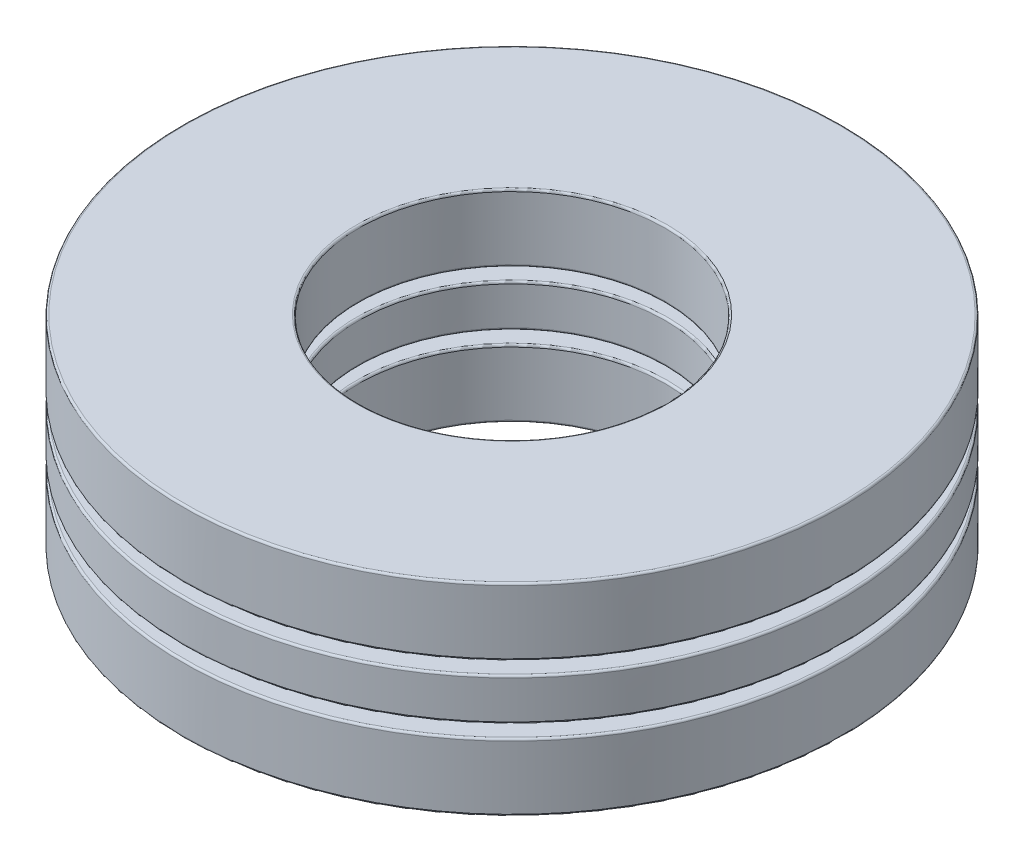
ISO-10303-21;
HEADER;
FILE_DESCRIPTION(('STEP AP214'),'2;1');
FILE_NAME('part.step','',(''),(''),'','','');
FILE_SCHEMA(('AUTOMOTIVE_DESIGN { 1 0 10303 214 1 1 1 1 }'));
ENDSEC;
DATA;
#1=APPLICATION_CONTEXT('core data for automotive mechanical design processes');
#2=APPLICATION_PROTOCOL_DEFINITION('international standard','automotive_design',2000,#1);
#3=PRODUCT_CONTEXT('',#1,'mechanical');
#4=PRODUCT('Part','Part','',(#3));
#5=PRODUCT_RELATED_PRODUCT_CATEGORY('part','',(#4));
#6=PRODUCT_DEFINITION_FORMATION('','',#4);
#7=PRODUCT_DEFINITION_CONTEXT('part definition',#1,'design');
#8=PRODUCT_DEFINITION('design','',#6,#7);
#9=PRODUCT_DEFINITION_SHAPE('','',#8);
#10=(LENGTH_UNIT() NAMED_UNIT(*) SI_UNIT(.MILLI.,.METRE.));
#11=(NAMED_UNIT(*) PLANE_ANGLE_UNIT() SI_UNIT($,.RADIAN.));
#12=(NAMED_UNIT(*) SI_UNIT($,.STERADIAN.) SOLID_ANGLE_UNIT());
#13=UNCERTAINTY_MEASURE_WITH_UNIT(LENGTH_MEASURE(1.E-05),#10,'distance_accuracy_value','');
#14=(GEOMETRIC_REPRESENTATION_CONTEXT(3) GLOBAL_UNCERTAINTY_ASSIGNED_CONTEXT((#13)) GLOBAL_UNIT_ASSIGNED_CONTEXT((#10,
#11,#12)) REPRESENTATION_CONTEXT('',''));
#15=CARTESIAN_POINT('',(0.,0.,0.));
#16=DIRECTION('',(0.,0.,1.));
#17=DIRECTION('',(1.,0.,0.));
#18=AXIS2_PLACEMENT_3D('',#15,#16,#17);
#19=CARTESIAN_POINT('',(0.,-3.1623,0.));
#20=DIRECTION('',(0.,-1.,0.));
#21=DIRECTION('',(0.,0.,-1.));
#22=AXIS2_PLACEMENT_3D('',#19,#20,#21);
#23=CYLINDRICAL_SURFACE('',#22,10.31875);
#24=CARTESIAN_POINT('',(0.,-3.099054,0.));
#25=DIRECTION('',(0.,1.,0.));
#26=DIRECTION('',(0.,0.,1.));
#27=AXIS2_PLACEMENT_3D('',#24,#25,#26);
#28=CIRCLE('',#27,10.31875);
#29=CARTESIAN_POINT('',(0.,-3.099054,10.31875));
#30=VERTEX_POINT('',#29);
#31=EDGE_CURVE('E11',#30,#30,#28,.T.);
#32=ORIENTED_EDGE('',*,*,#31,.T.);
#33=EDGE_LOOP('',(#32));
#34=FACE_BOUND('',#33,.T.);
#35=CARTESIAN_POINT('',(0.,-1.117346,0.));
#36=DIRECTION('',(0.,-1.,0.));
#37=DIRECTION('',(0.,0.,-1.));
#38=AXIS2_PLACEMENT_3D('',#35,#36,#37);
#39=CIRCLE('',#38,10.31875);
#40=CARTESIAN_POINT('',(0.,-1.117346,-10.31875));
#41=VERTEX_POINT('',#40);
#42=EDGE_CURVE('E48',#41,#41,#39,.T.);
#43=ORIENTED_EDGE('',*,*,#42,.T.);
#44=EDGE_LOOP('',(#43));
#45=FACE_BOUND('',#44,.T.);
#46=ADVANCED_FACE('F41',(#34,#45),#23,.T.);
#47=CARTESIAN_POINT('',(0.,-1.0541,10.31875));
#48=DIRECTION('',(0.,-1.,0.));
#49=DIRECTION('',(0.,0.,-1.));
#50=AXIS2_PLACEMENT_3D('',#47,#48,#49);
#51=PLANE('',#50);
#52=CARTESIAN_POINT('',(0.,-1.0541,0.));
#53=DIRECTION('',(0.,-1.,0.));
#54=DIRECTION('',(0.,0.,-1.));
#55=AXIS2_PLACEMENT_3D('',#52,#53,#54);
#56=CIRCLE('',#55,4.863846);
#57=CARTESIAN_POINT('',(0.,-1.0541,-4.863846));
#58=VERTEX_POINT('',#57);
#59=EDGE_CURVE('E52',#58,#58,#56,.T.);
#60=ORIENTED_EDGE('',*,*,#59,.T.);
#61=EDGE_LOOP('',(#60));
#62=FACE_BOUND('',#61,.T.);
#63=CARTESIAN_POINT('',(0.,-1.0541,0.));
#64=DIRECTION('',(0.,-1.,0.));
#65=DIRECTION('',(0.,0.,-1.));
#66=AXIS2_PLACEMENT_3D('',#63,#64,#65);
#67=CIRCLE('',#66,10.255504);
#68=CARTESIAN_POINT('',(0.,-1.0541,-10.255504));
#69=VERTEX_POINT('',#68);
#70=EDGE_CURVE('E56',#69,#69,#67,.F.);
#71=ORIENTED_EDGE('',*,*,#70,.T.);
#72=EDGE_LOOP('',(#71));
#73=FACE_BOUND('',#72,.T.);
#74=ADVANCED_FACE('F84',(#62,#73),#51,.F.);
#75=CARTESIAN_POINT('',(0.,-3.1623,0.));
#76=DIRECTION('',(0.,-1.,0.));
#77=DIRECTION('',(0.,0.,-1.));
#78=AXIS2_PLACEMENT_3D('',#75,#76,#77);
#79=CYLINDRICAL_SURFACE('',#78,4.8006);
#80=CARTESIAN_POINT('',(0.,-3.099054,0.));
#81=DIRECTION('',(0.,1.,0.));
#82=DIRECTION('',(0.,0.,1.));
#83=AXIS2_PLACEMENT_3D('',#80,#81,#82);
#84=CIRCLE('',#83,4.8006);
#85=CARTESIAN_POINT('',(0.,-3.099054,4.8006));
#86=VERTEX_POINT('',#85);
#87=EDGE_CURVE('E67',#86,#86,#84,.F.);
#88=ORIENTED_EDGE('',*,*,#87,.T.);
#89=EDGE_LOOP('',(#88));
#90=FACE_BOUND('',#89,.T.);
#91=CARTESIAN_POINT('',(0.,-1.117346,0.));
#92=DIRECTION('',(0.,-1.,0.));
#93=DIRECTION('',(0.,0.,-1.));
#94=AXIS2_PLACEMENT_3D('',#91,#92,#93);
#95=CIRCLE('',#94,4.8006);
#96=CARTESIAN_POINT('',(0.,-1.117346,-4.8006));
#97=VERTEX_POINT('',#96);
#98=EDGE_CURVE('E70',#97,#97,#95,.F.);
#99=ORIENTED_EDGE('',*,*,#98,.T.);
#100=EDGE_LOOP('',(#99));
#101=FACE_BOUND('',#100,.T.);
#102=ADVANCED_FACE('F74',(#90,#101),#79,.F.);
#103=CARTESIAN_POINT('',(0.,-3.1623,10.31875));
#104=DIRECTION('',(0.,1.,0.));
#105=DIRECTION('',(0.,0.,1.));
#106=AXIS2_PLACEMENT_3D('',#103,#104,#105);
#107=PLANE('',#106);
#108=CARTESIAN_POINT('',(0.,-3.1623,0.));
#109=DIRECTION('',(0.,1.,0.));
#110=DIRECTION('',(0.,0.,1.));
#111=AXIS2_PLACEMENT_3D('',#108,#109,#110);
#112=CIRCLE('',#111,4.863846);
#113=CARTESIAN_POINT('',(0.,-3.1623,4.863846));
#114=VERTEX_POINT('',#113);
#115=EDGE_CURVE('E61',#114,#114,#112,.T.);
#116=ORIENTED_EDGE('',*,*,#115,.T.);
#117=EDGE_LOOP('',(#116));
#118=FACE_BOUND('',#117,.T.);
#119=CARTESIAN_POINT('',(0.,-3.1623,0.));
#120=DIRECTION('',(0.,1.,0.));
#121=DIRECTION('',(0.,0.,1.));
#122=AXIS2_PLACEMENT_3D('',#119,#120,#121);
#123=CIRCLE('',#122,10.255504);
#124=CARTESIAN_POINT('',(0.,-3.1623,10.255504));
#125=VERTEX_POINT('',#124);
#126=EDGE_CURVE('E64',#125,#125,#123,.F.);
#127=ORIENTED_EDGE('',*,*,#126,.T.);
#128=EDGE_LOOP('',(#127));
#129=FACE_BOUND('',#128,.T.);
#130=ADVANCED_FACE('F103',(#118,#129),#107,.F.);
#131=CARTESIAN_POINT('',(0.,-3.099054,0.));
#132=DIRECTION('',(0.,1.,0.));
#133=DIRECTION('',(0.,0.,1.));
#134=AXIS2_PLACEMENT_3D('',#131,#132,#133);
#135=TOROIDAL_SURFACE('',#134,4.863846,0.063246);
#136=ORIENTED_EDGE('',*,*,#115,.F.);
#137=EDGE_LOOP('',(#136));
#138=FACE_BOUND('',#137,.T.);
#139=ORIENTED_EDGE('',*,*,#87,.F.);
#140=EDGE_LOOP('',(#139));
#141=FACE_BOUND('',#140,.T.);
#142=ADVANCED_FACE('F80',(#138,#141),#135,.T.);
#143=CARTESIAN_POINT('',(0.,-1.117346,0.));
#144=DIRECTION('',(0.,-1.,0.));
#145=DIRECTION('',(0.,0.,-1.));
#146=AXIS2_PLACEMENT_3D('',#143,#144,#145);
#147=TOROIDAL_SURFACE('',#146,4.863846,0.063246);
#148=ORIENTED_EDGE('',*,*,#98,.F.);
#149=EDGE_LOOP('',(#148));
#150=FACE_BOUND('',#149,.T.);
#151=ORIENTED_EDGE('',*,*,#59,.F.);
#152=EDGE_LOOP('',(#151));
#153=FACE_BOUND('',#152,.T.);
#154=ADVANCED_FACE('F76',(#150,#153),#147,.T.);
#155=CARTESIAN_POINT('',(0.,-3.099054,0.));
#156=DIRECTION('',(0.,1.,0.));
#157=DIRECTION('',(0.,0.,1.));
#158=AXIS2_PLACEMENT_3D('',#155,#156,#157);
#159=TOROIDAL_SURFACE('',#158,10.255504,0.063246);
#160=ORIENTED_EDGE('',*,*,#31,.F.);
#161=EDGE_LOOP('',(#160));
#162=FACE_BOUND('',#161,.T.);
#163=ORIENTED_EDGE('',*,*,#126,.F.);
#164=EDGE_LOOP('',(#163));
#165=FACE_BOUND('',#164,.T.);
#166=ADVANCED_FACE('F79',(#162,#165),#159,.T.);
#167=CARTESIAN_POINT('',(0.,-1.117346,0.));
#168=DIRECTION('',(0.,-1.,0.));
#169=DIRECTION('',(0.,0.,-1.));
#170=AXIS2_PLACEMENT_3D('',#167,#168,#169);
#171=TOROIDAL_SURFACE('',#170,10.255504,0.063246);
#172=ORIENTED_EDGE('',*,*,#70,.F.);
#173=EDGE_LOOP('',(#172));
#174=FACE_BOUND('',#173,.T.);
#175=ORIENTED_EDGE('',*,*,#42,.F.);
#176=EDGE_LOOP('',(#175));
#177=FACE_BOUND('',#176,.T.);
#178=ADVANCED_FACE('F43',(#174,#177),#171,.T.);
#179=CLOSED_SHELL('',(#46,#74,#102,#130,#142,#154,#166,#178));
#180=MANIFOLD_SOLID_BREP('B2',#179);
#181=CARTESIAN_POINT('',(0.,-3.1623,0.));
#182=DIRECTION('',(0.,-1.,0.));
#183=DIRECTION('',(0.,0.,-1.));
#184=AXIS2_PLACEMENT_3D('',#181,#182,#183);
#185=CYLINDRICAL_SURFACE('',#184,10.31875);
#186=CARTESIAN_POINT('',(0.,1.117346,0.));
#187=DIRECTION('',(0.,1.,0.));
#188=DIRECTION('',(0.,0.,1.));
#189=AXIS2_PLACEMENT_3D('',#186,#187,#188);
#190=CIRCLE('',#189,10.31875);
#191=CARTESIAN_POINT('',(0.,1.117346,10.31875));
#192=VERTEX_POINT('',#191);
#193=EDGE_CURVE('E40',#192,#192,#190,.T.);
#194=ORIENTED_EDGE('',*,*,#193,.T.);
#195=EDGE_LOOP('',(#194));
#196=FACE_BOUND('',#195,.T.);
#197=CARTESIAN_POINT('',(0.,3.099054,0.));
#198=DIRECTION('',(0.,-1.,0.));
#199=DIRECTION('',(0.,0.,-1.));
#200=AXIS2_PLACEMENT_3D('',#197,#198,#199);
#201=CIRCLE('',#200,10.31875);
#202=CARTESIAN_POINT('',(0.,3.099054,-10.31875));
#203=VERTEX_POINT('',#202);
#204=EDGE_CURVE('E175',#203,#203,#201,.T.);
#205=ORIENTED_EDGE('',*,*,#204,.T.);
#206=EDGE_LOOP('',(#205));
#207=FACE_BOUND('',#206,.T.);
#208=ADVANCED_FACE('F168',(#196,#207),#185,.T.);
#209=CARTESIAN_POINT('',(0.,3.1623,10.31875));
#210=DIRECTION('',(0.,-1.,0.));
#211=DIRECTION('',(0.,0.,-1.));
#212=AXIS2_PLACEMENT_3D('',#209,#210,#211);
#213=PLANE('',#212);
#214=CARTESIAN_POINT('',(0.,3.1623,0.));
#215=DIRECTION('',(0.,-1.,0.));
#216=DIRECTION('',(0.,0.,-1.));
#217=AXIS2_PLACEMENT_3D('',#214,#215,#216);
#218=CIRCLE('',#217,4.863846);
#219=CARTESIAN_POINT('',(0.,3.1623,-4.863846));
#220=VERTEX_POINT('',#219);
#221=EDGE_CURVE('E179',#220,#220,#218,.T.);
#222=ORIENTED_EDGE('',*,*,#221,.T.);
#223=EDGE_LOOP('',(#222));
#224=FACE_BOUND('',#223,.T.);
#225=CARTESIAN_POINT('',(0.,3.1623,0.));
#226=DIRECTION('',(0.,-1.,0.));
#227=DIRECTION('',(0.,0.,-1.));
#228=AXIS2_PLACEMENT_3D('',#225,#226,#227);
#229=CIRCLE('',#228,10.255504);
#230=CARTESIAN_POINT('',(0.,3.1623,-10.255504));
#231=VERTEX_POINT('',#230);
#232=EDGE_CURVE('E183',#231,#231,#229,.F.);
#233=ORIENTED_EDGE('',*,*,#232,.T.);
#234=EDGE_LOOP('',(#233));
#235=FACE_BOUND('',#234,.T.);
#236=ADVANCED_FACE('F211',(#224,#235),#213,.F.);
#237=CARTESIAN_POINT('',(0.,-3.1623,0.));
#238=DIRECTION('',(0.,-1.,0.));
#239=DIRECTION('',(0.,0.,-1.));
#240=AXIS2_PLACEMENT_3D('',#237,#238,#239);
#241=CYLINDRICAL_SURFACE('',#240,4.8006);
#242=CARTESIAN_POINT('',(0.,1.117346,0.));
#243=DIRECTION('',(0.,1.,0.));
#244=DIRECTION('',(0.,0.,1.));
#245=AXIS2_PLACEMENT_3D('',#242,#243,#244);
#246=CIRCLE('',#245,4.8006);
#247=CARTESIAN_POINT('',(0.,1.117346,4.8006));
#248=VERTEX_POINT('',#247);
#249=EDGE_CURVE('E194',#248,#248,#246,.F.);
#250=ORIENTED_EDGE('',*,*,#249,.T.);
#251=EDGE_LOOP('',(#250));
#252=FACE_BOUND('',#251,.T.);
#253=CARTESIAN_POINT('',(0.,3.099054,0.));
#254=DIRECTION('',(0.,-1.,0.));
#255=DIRECTION('',(0.,0.,-1.));
#256=AXIS2_PLACEMENT_3D('',#253,#254,#255);
#257=CIRCLE('',#256,4.8006);
#258=CARTESIAN_POINT('',(0.,3.099054,-4.8006));
#259=VERTEX_POINT('',#258);
#260=EDGE_CURVE('E197',#259,#259,#257,.F.);
#261=ORIENTED_EDGE('',*,*,#260,.T.);
#262=EDGE_LOOP('',(#261));
#263=FACE_BOUND('',#262,.T.);
#264=ADVANCED_FACE('F201',(#252,#263),#241,.F.);
#265=CARTESIAN_POINT('',(0.,1.0541,10.31875));
#266=DIRECTION('',(0.,1.,0.));
#267=DIRECTION('',(0.,0.,1.));
#268=AXIS2_PLACEMENT_3D('',#265,#266,#267);
#269=PLANE('',#268);
#270=CARTESIAN_POINT('',(0.,1.0541,0.));
#271=DIRECTION('',(0.,1.,0.));
#272=DIRECTION('',(0.,0.,1.));
#273=AXIS2_PLACEMENT_3D('',#270,#271,#272);
#274=CIRCLE('',#273,4.863846);
#275=CARTESIAN_POINT('',(0.,1.0541,4.863846));
#276=VERTEX_POINT('',#275);
#277=EDGE_CURVE('E188',#276,#276,#274,.T.);
#278=ORIENTED_EDGE('',*,*,#277,.T.);
#279=EDGE_LOOP('',(#278));
#280=FACE_BOUND('',#279,.T.);
#281=CARTESIAN_POINT('',(0.,1.0541,0.));
#282=DIRECTION('',(0.,1.,0.));
#283=DIRECTION('',(0.,0.,1.));
#284=AXIS2_PLACEMENT_3D('',#281,#282,#283);
#285=CIRCLE('',#284,10.255504);
#286=CARTESIAN_POINT('',(0.,1.0541,10.255504));
#287=VERTEX_POINT('',#286);
#288=EDGE_CURVE('E191',#287,#287,#285,.F.);
#289=ORIENTED_EDGE('',*,*,#288,.T.);
#290=EDGE_LOOP('',(#289));
#291=FACE_BOUND('',#290,.T.);
#292=ADVANCED_FACE('F230',(#280,#291),#269,.F.);
#293=CARTESIAN_POINT('',(0.,1.117346,0.));
#294=DIRECTION('',(0.,1.,0.));
#295=DIRECTION('',(0.,0.,1.));
#296=AXIS2_PLACEMENT_3D('',#293,#294,#295);
#297=TOROIDAL_SURFACE('',#296,4.863846,0.063246);
#298=ORIENTED_EDGE('',*,*,#277,.F.);
#299=EDGE_LOOP('',(#298));
#300=FACE_BOUND('',#299,.T.);
#301=ORIENTED_EDGE('',*,*,#249,.F.);
#302=EDGE_LOOP('',(#301));
#303=FACE_BOUND('',#302,.T.);
#304=ADVANCED_FACE('F207',(#300,#303),#297,.T.);
#305=CARTESIAN_POINT('',(0.,3.099054,0.));
#306=DIRECTION('',(0.,-1.,0.));
#307=DIRECTION('',(0.,0.,-1.));
#308=AXIS2_PLACEMENT_3D('',#305,#306,#307);
#309=TOROIDAL_SURFACE('',#308,4.863846,0.063246);
#310=ORIENTED_EDGE('',*,*,#260,.F.);
#311=EDGE_LOOP('',(#310));
#312=FACE_BOUND('',#311,.T.);
#313=ORIENTED_EDGE('',*,*,#221,.F.);
#314=EDGE_LOOP('',(#313));
#315=FACE_BOUND('',#314,.T.);
#316=ADVANCED_FACE('F203',(#312,#315),#309,.T.);
#317=CARTESIAN_POINT('',(0.,1.117346,0.));
#318=DIRECTION('',(0.,1.,0.));
#319=DIRECTION('',(0.,0.,1.));
#320=AXIS2_PLACEMENT_3D('',#317,#318,#319);
#321=TOROIDAL_SURFACE('',#320,10.255504,0.063246);
#322=ORIENTED_EDGE('',*,*,#193,.F.);
#323=EDGE_LOOP('',(#322));
#324=FACE_BOUND('',#323,.T.);
#325=ORIENTED_EDGE('',*,*,#288,.F.);
#326=EDGE_LOOP('',(#325));
#327=FACE_BOUND('',#326,.T.);
#328=ADVANCED_FACE('F206',(#324,#327),#321,.T.);
#329=CARTESIAN_POINT('',(0.,3.099054,0.));
#330=DIRECTION('',(0.,-1.,0.));
#331=DIRECTION('',(0.,0.,-1.));
#332=AXIS2_PLACEMENT_3D('',#329,#330,#331);
#333=TOROIDAL_SURFACE('',#332,10.255504,0.063246);
#334=ORIENTED_EDGE('',*,*,#232,.F.);
#335=EDGE_LOOP('',(#334));
#336=FACE_BOUND('',#335,.T.);
#337=ORIENTED_EDGE('',*,*,#204,.F.);
#338=EDGE_LOOP('',(#337));
#339=FACE_BOUND('',#338,.T.);
#340=ADVANCED_FACE('F170',(#336,#339),#333,.T.);
#341=CLOSED_SHELL('',(#208,#236,#264,#292,#304,#316,#328,#340));
#342=MANIFOLD_SOLID_BREP('B6',#341);
#343=CARTESIAN_POINT('',(-7.559675,0.,0.));
#344=DIRECTION('',(0.,1.,0.));
#345=DIRECTION('',(1.,0.,0.));
#346=AXIS2_PLACEMENT_3D('',#343,#344,#345);
#347=SPHERICAL_SURFACE('',#346,1.0541);
#348=CARTESIAN_POINT('',(-7.559675,1.0541,0.));
#349=VERTEX_POINT('',#348);
#350=VERTEX_LOOP('',#349);
#351=FACE_BOUND('',#350,.T.);
#352=ADVANCED_FACE('F295',(#351),#347,.T.);
#353=CLOSED_SHELL('',(#352));
#354=MANIFOLD_SOLID_BREP('B35',#353);
#355=CARTESIAN_POINT('',(0.,0.,-7.559675));
#356=DIRECTION('',(0.,1.,0.));
#357=DIRECTION('',(0.,0.,1.));
#358=AXIS2_PLACEMENT_3D('',#355,#356,#357);
#359=SPHERICAL_SURFACE('',#358,1.0541);
#360=CARTESIAN_POINT('',(0.,1.0541,-7.559675));
#361=VERTEX_POINT('',#360);
#362=VERTEX_LOOP('',#361);
#363=FACE_BOUND('',#362,.T.);
#364=ADVANCED_FACE('F313',(#363),#359,.T.);
#365=CLOSED_SHELL('',(#364));
#366=MANIFOLD_SOLID_BREP('B164',#365);
#367=CARTESIAN_POINT('',(7.559675,0.,0.));
#368=DIRECTION('',(0.,1.,0.));
#369=DIRECTION('',(-1.,0.,0.));
#370=AXIS2_PLACEMENT_3D('',#367,#368,#369);
#371=SPHERICAL_SURFACE('',#370,1.0541);
#372=CARTESIAN_POINT('',(7.559675,1.0541,0.));
#373=VERTEX_POINT('',#372);
#374=VERTEX_LOOP('',#373);
#375=FACE_BOUND('',#374,.T.);
#376=ADVANCED_FACE('F331',(#375),#371,.T.);
#377=CLOSED_SHELL('',(#376));
#378=MANIFOLD_SOLID_BREP('B291',#377);
#379=CARTESIAN_POINT('',(0.,0.,7.559675));
#380=DIRECTION('',(0.,1.,0.));
#381=DIRECTION('',(0.,0.,-1.));
#382=AXIS2_PLACEMENT_3D('',#379,#380,#381);
#383=SPHERICAL_SURFACE('',#382,1.0541);
#384=CARTESIAN_POINT('',(0.,1.0541,7.559675));
#385=VERTEX_POINT('',#384);
#386=VERTEX_LOOP('',#385);
#387=FACE_BOUND('',#386,.T.);
#388=ADVANCED_FACE('F350',(#387),#383,.T.);
#389=CLOSED_SHELL('',(#388));
#390=MANIFOLD_SOLID_BREP('B309',#389);
#391=CARTESIAN_POINT('',(0.,-3.1623,0.));
#392=DIRECTION('',(0.,-1.,0.));
#393=DIRECTION('',(0.,0.,-1.));
#394=AXIS2_PLACEMENT_3D('',#391,#392,#393);
#395=CYLINDRICAL_SURFACE('',#394,10.31875);
#396=CARTESIAN_POINT('',(0.,-0.595566500000002,0.));
#397=DIRECTION('',(0.,1.,0.));
#398=DIRECTION('',(0.,0.,1.));
#399=AXIS2_PLACEMENT_3D('',#396,#397,#398);
#400=CIRCLE('',#399,10.31875);
#401=CARTESIAN_POINT('',(0.,-0.595566500000002,10.31875));
#402=VERTEX_POINT('',#401);
#403=EDGE_CURVE('E349',#402,#402,#400,.T.);
#404=ORIENTED_EDGE('',*,*,#403,.T.);
#405=EDGE_LOOP('',(#404));
#406=FACE_BOUND('',#405,.T.);
#407=CARTESIAN_POINT('',(0.,0.595566499999999,0.));
#408=DIRECTION('',(0.,-1.,0.));
#409=DIRECTION('',(0.,0.,-1.));
#410=AXIS2_PLACEMENT_3D('',#407,#408,#409);
#411=CIRCLE('',#410,10.31875);
#412=CARTESIAN_POINT('',(0.,0.595566499999999,-10.31875));
#413=VERTEX_POINT('',#412);
#414=EDGE_CURVE('E369',#413,#413,#411,.T.);
#415=ORIENTED_EDGE('',*,*,#414,.T.);
#416=EDGE_LOOP('',(#415));
#417=FACE_BOUND('',#416,.T.);
#418=ADVANCED_FACE('F362',(#406,#417),#395,.T.);
#419=CARTESIAN_POINT('',(0.,-0.658812500000002,10.31875));
#420=DIRECTION('',(0.,1.,0.));
#421=DIRECTION('',(0.,0.,1.));
#422=AXIS2_PLACEMENT_3D('',#419,#420,#421);
#423=PLANE('',#422);
#424=CARTESIAN_POINT('',(0.,-0.658812500000002,0.));
#425=DIRECTION('',(0.,1.,0.));
#426=DIRECTION('',(0.,0.,1.));
#427=AXIS2_PLACEMENT_3D('',#424,#425,#426);
#428=CIRCLE('',#427,4.863846);
#429=CARTESIAN_POINT('',(0.,-0.658812500000002,4.863846));
#430=VERTEX_POINT('',#429);
#431=EDGE_CURVE('E382',#430,#430,#428,.T.);
#432=ORIENTED_EDGE('',*,*,#431,.T.);
#433=EDGE_LOOP('',(#432));
#434=FACE_BOUND('',#433,.T.);
#435=CARTESIAN_POINT('',(0.,-0.658812500000002,0.));
#436=DIRECTION('',(0.,1.,0.));
#437=DIRECTION('',(0.,0.,1.));
#438=AXIS2_PLACEMENT_3D('',#435,#436,#437);
#439=CIRCLE('',#438,10.255504);
#440=CARTESIAN_POINT('',(0.,-0.658812500000002,10.255504));
#441=VERTEX_POINT('',#440);
#442=EDGE_CURVE('E385',#441,#441,#439,.F.);
#443=ORIENTED_EDGE('',*,*,#442,.T.);
#444=EDGE_LOOP('',(#443));
#445=FACE_BOUND('',#444,.T.);
#446=CARTESIAN_POINT('',(-7.559675,-0.658812500000002,0.));
#447=DIRECTION('',(0.,1.,0.));
#448=DIRECTION('',(-1.,0.,0.));
#449=AXIS2_PLACEMENT_3D('',#446,#447,#448);
#450=CIRCLE('',#449,0.822856548763968);
#451=CARTESIAN_POINT('',(-8.38253154876397,-0.658812500000002,0.));
#452=VERTEX_POINT('',#451);
#453=EDGE_CURVE('E412',#452,#452,#450,.T.);
#454=ORIENTED_EDGE('',*,*,#453,.T.);
#455=EDGE_LOOP('',(#454));
#456=FACE_BOUND('',#455,.T.);
#457=CARTESIAN_POINT('',(0.,-0.658812500000002,-7.559675));
#458=DIRECTION('',(0.,1.,0.));
#459=DIRECTION('',(0.,0.,-1.));
#460=AXIS2_PLACEMENT_3D('',#457,#458,#459);
#461=CIRCLE('',#460,0.822856548763968);
#462=CARTESIAN_POINT('',(0.,-0.658812500000002,-8.38253154876397));
#463=VERTEX_POINT('',#462);
#464=EDGE_CURVE('E406',#463,#463,#461,.T.);
#465=ORIENTED_EDGE('',*,*,#464,.T.);
#466=EDGE_LOOP('',(#465));
#467=FACE_BOUND('',#466,.T.);
#468=CARTESIAN_POINT('',(7.559675,-0.658812500000002,0.));
#469=DIRECTION('',(0.,1.,0.));
#470=DIRECTION('',(1.,0.,0.));
#471=AXIS2_PLACEMENT_3D('',#468,#469,#470);
#472=CIRCLE('',#471,0.822856548763968);
#473=CARTESIAN_POINT('',(8.38253154876397,-0.658812500000002,0.));
#474=VERTEX_POINT('',#473);
#475=EDGE_CURVE('E398',#474,#474,#472,.T.);
#476=ORIENTED_EDGE('',*,*,#475,.T.);
#477=EDGE_LOOP('',(#476));
#478=FACE_BOUND('',#477,.T.);
#479=CARTESIAN_POINT('',(0.,-0.658812500000002,7.559675));
#480=DIRECTION('',(0.,1.,0.));
#481=DIRECTION('',(0.,0.,1.));
#482=AXIS2_PLACEMENT_3D('',#479,#480,#481);
#483=CIRCLE('',#482,0.822856548763968);
#484=CARTESIAN_POINT('',(0.,-0.658812500000002,8.38253154876397));
#485=VERTEX_POINT('',#484);
#486=EDGE_CURVE('E394',#485,#485,#483,.T.);
#487=ORIENTED_EDGE('',*,*,#486,.T.);
#488=EDGE_LOOP('',(#487));
#489=FACE_BOUND('',#488,.T.);
#490=ADVANCED_FACE('F430',(#434,#445,#456,#467,#478,#489),#423,.F.);
#491=CARTESIAN_POINT('',(0.,-3.1623,0.));
#492=DIRECTION('',(0.,-1.,0.));
#493=DIRECTION('',(0.,0.,-1.));
#494=AXIS2_PLACEMENT_3D('',#491,#492,#493);
#495=CYLINDRICAL_SURFACE('',#494,4.8006);
#496=CARTESIAN_POINT('',(0.,-0.595566500000002,0.));
#497=DIRECTION('',(0.,1.,0.));
#498=DIRECTION('',(0.,0.,1.));
#499=AXIS2_PLACEMENT_3D('',#496,#497,#498);
#500=CIRCLE('',#499,4.8006);
#501=CARTESIAN_POINT('',(0.,-0.595566500000002,4.8006));
#502=VERTEX_POINT('',#501);
#503=EDGE_CURVE('E388',#502,#502,#500,.F.);
#504=ORIENTED_EDGE('',*,*,#503,.T.);
#505=EDGE_LOOP('',(#504));
#506=FACE_BOUND('',#505,.T.);
#507=CARTESIAN_POINT('',(0.,0.595566499999999,0.));
#508=DIRECTION('',(0.,-1.,0.));
#509=DIRECTION('',(0.,0.,-1.));
#510=AXIS2_PLACEMENT_3D('',#507,#508,#509);
#511=CIRCLE('',#510,4.8006);
#512=CARTESIAN_POINT('',(0.,0.595566499999999,-4.8006));
#513=VERTEX_POINT('',#512);
#514=EDGE_CURVE('E391',#513,#513,#511,.F.);
#515=ORIENTED_EDGE('',*,*,#514,.T.);
#516=EDGE_LOOP('',(#515));
#517=FACE_BOUND('',#516,.T.);
#518=ADVANCED_FACE('F433',(#506,#517),#495,.F.);
#519=CARTESIAN_POINT('',(0.,0.658812499999998,10.31875));
#520=DIRECTION('',(0.,-1.,0.));
#521=DIRECTION('',(0.,0.,-1.));
#522=AXIS2_PLACEMENT_3D('',#519,#520,#521);
#523=PLANE('',#522);
#524=CARTESIAN_POINT('',(0.,0.658812499999998,0.));
#525=DIRECTION('',(0.,-1.,0.));
#526=DIRECTION('',(0.,0.,-1.));
#527=AXIS2_PLACEMENT_3D('',#524,#525,#526);
#528=CIRCLE('',#527,4.863846);
#529=CARTESIAN_POINT('',(0.,0.658812499999998,-4.863846));
#530=VERTEX_POINT('',#529);
#531=EDGE_CURVE('E373',#530,#530,#528,.T.);
#532=ORIENTED_EDGE('',*,*,#531,.T.);
#533=EDGE_LOOP('',(#532));
#534=FACE_BOUND('',#533,.T.);
#535=CARTESIAN_POINT('',(0.,0.658812499999998,0.));
#536=DIRECTION('',(0.,-1.,0.));
#537=DIRECTION('',(0.,0.,-1.));
#538=AXIS2_PLACEMENT_3D('',#535,#536,#537);
#539=CIRCLE('',#538,10.255504);
#540=CARTESIAN_POINT('',(0.,0.658812499999998,-10.255504));
#541=VERTEX_POINT('',#540);
#542=EDGE_CURVE('E377',#541,#541,#539,.F.);
#543=ORIENTED_EDGE('',*,*,#542,.T.);
#544=EDGE_LOOP('',(#543));
#545=FACE_BOUND('',#544,.T.);
#546=CARTESIAN_POINT('',(-7.559675,0.658812499999998,0.));
#547=DIRECTION('',(0.,-1.,0.));
#548=DIRECTION('',(1.,0.,0.));
#549=AXIS2_PLACEMENT_3D('',#546,#547,#548);
#550=CIRCLE('',#549,0.82285654876397);
#551=CARTESIAN_POINT('',(-6.73681845123603,0.658812499999998,0.));
#552=VERTEX_POINT('',#551);
#553=EDGE_CURVE('E415',#552,#552,#550,.T.);
#554=ORIENTED_EDGE('',*,*,#553,.T.);
#555=EDGE_LOOP('',(#554));
#556=FACE_BOUND('',#555,.T.);
#557=CARTESIAN_POINT('',(0.,0.658812499999998,-7.559675));
#558=DIRECTION('',(0.,-1.,0.));
#559=DIRECTION('',(0.,0.,1.));
#560=AXIS2_PLACEMENT_3D('',#557,#558,#559);
#561=CIRCLE('',#560,0.82285654876397);
#562=CARTESIAN_POINT('',(0.,0.658812499999998,-6.73681845123603));
#563=VERTEX_POINT('',#562);
#564=EDGE_CURVE('E409',#563,#563,#561,.T.);
#565=ORIENTED_EDGE('',*,*,#564,.T.);
#566=EDGE_LOOP('',(#565));
#567=FACE_BOUND('',#566,.T.);
#568=CARTESIAN_POINT('',(7.559675,0.658812499999998,0.));
#569=DIRECTION('',(0.,-1.,0.));
#570=DIRECTION('',(-1.,0.,0.));
#571=AXIS2_PLACEMENT_3D('',#568,#569,#570);
#572=CIRCLE('',#571,0.82285654876397);
#573=CARTESIAN_POINT('',(6.73681845123603,0.658812499999998,0.));
#574=VERTEX_POINT('',#573);
#575=EDGE_CURVE('E403',#574,#574,#572,.T.);
#576=ORIENTED_EDGE('',*,*,#575,.T.);
#577=EDGE_LOOP('',(#576));
#578=FACE_BOUND('',#577,.T.);
#579=CARTESIAN_POINT('',(0.,0.658812499999998,7.559675));
#580=DIRECTION('',(0.,-1.,0.));
#581=DIRECTION('',(0.,0.,-1.));
#582=AXIS2_PLACEMENT_3D('',#579,#580,#581);
#583=CIRCLE('',#582,0.82285654876397);
#584=CARTESIAN_POINT('',(0.,0.658812499999998,6.73681845123603));
#585=VERTEX_POINT('',#584);
#586=EDGE_CURVE('E395',#585,#585,#583,.T.);
#587=ORIENTED_EDGE('',*,*,#586,.T.);
#588=EDGE_LOOP('',(#587));
#589=FACE_BOUND('',#588,.T.);
#590=ADVANCED_FACE('F419',(#534,#545,#556,#567,#578,#589),#523,.F.);
#591=CARTESIAN_POINT('',(0.,0.,7.559675));
#592=DIRECTION('',(0.,1.,0.));
#593=DIRECTION('',(0.,0.,-1.));
#594=AXIS2_PLACEMENT_3D('',#591,#592,#593);
#595=SPHERICAL_SURFACE('',#594,1.0541);
#596=ORIENTED_EDGE('',*,*,#586,.F.);
#597=EDGE_LOOP('',(#596));
#598=FACE_BOUND('',#597,.T.);
#599=ORIENTED_EDGE('',*,*,#486,.F.);
#600=EDGE_LOOP('',(#599));
#601=FACE_BOUND('',#600,.T.);
#602=ADVANCED_FACE('F442',(#598,#601),#595,.F.);
#603=CARTESIAN_POINT('',(7.559675,0.,0.));
#604=DIRECTION('',(0.,1.,0.));
#605=DIRECTION('',(-1.,0.,0.));
#606=AXIS2_PLACEMENT_3D('',#603,#604,#605);
#607=SPHERICAL_SURFACE('',#606,1.0541);
#608=ORIENTED_EDGE('',*,*,#575,.F.);
#609=EDGE_LOOP('',(#608));
#610=FACE_BOUND('',#609,.T.);
#611=ORIENTED_EDGE('',*,*,#475,.F.);
#612=EDGE_LOOP('',(#611));
#613=FACE_BOUND('',#612,.T.);
#614=ADVANCED_FACE('F444',(#610,#613),#607,.F.);
#615=CARTESIAN_POINT('',(0.,0.,-7.559675));
#616=DIRECTION('',(0.,1.,0.));
#617=DIRECTION('',(0.,0.,1.));
#618=AXIS2_PLACEMENT_3D('',#615,#616,#617);
#619=SPHERICAL_SURFACE('',#618,1.0541);
#620=ORIENTED_EDGE('',*,*,#564,.F.);
#621=EDGE_LOOP('',(#620));
#622=FACE_BOUND('',#621,.T.);
#623=ORIENTED_EDGE('',*,*,#464,.F.);
#624=EDGE_LOOP('',(#623));
#625=FACE_BOUND('',#624,.T.);
#626=ADVANCED_FACE('F426',(#622,#625),#619,.F.);
#627=CARTESIAN_POINT('',(-7.559675,0.,0.));
#628=DIRECTION('',(0.,1.,0.));
#629=DIRECTION('',(1.,0.,0.));
#630=AXIS2_PLACEMENT_3D('',#627,#628,#629);
#631=SPHERICAL_SURFACE('',#630,1.0541);
#632=ORIENTED_EDGE('',*,*,#553,.F.);
#633=EDGE_LOOP('',(#632));
#634=FACE_BOUND('',#633,.T.);
#635=ORIENTED_EDGE('',*,*,#453,.F.);
#636=EDGE_LOOP('',(#635));
#637=FACE_BOUND('',#636,.T.);
#638=ADVANCED_FACE('F422',(#634,#637),#631,.F.);
#639=CARTESIAN_POINT('',(0.,-0.595566500000002,0.));
#640=DIRECTION('',(0.,1.,0.));
#641=DIRECTION('',(0.,0.,1.));
#642=AXIS2_PLACEMENT_3D('',#639,#640,#641);
#643=TOROIDAL_SURFACE('',#642,4.863846,0.063246);
#644=ORIENTED_EDGE('',*,*,#431,.F.);
#645=EDGE_LOOP('',(#644));
#646=FACE_BOUND('',#645,.T.);
#647=ORIENTED_EDGE('',*,*,#503,.F.);
#648=EDGE_LOOP('',(#647));
#649=FACE_BOUND('',#648,.T.);
#650=ADVANCED_FACE('F425',(#646,#649),#643,.T.);
#651=CARTESIAN_POINT('',(0.,0.595566499999999,0.));
#652=DIRECTION('',(0.,-1.,0.));
#653=DIRECTION('',(0.,0.,-1.));
#654=AXIS2_PLACEMENT_3D('',#651,#652,#653);
#655=TOROIDAL_SURFACE('',#654,4.863846,0.063246);
#656=ORIENTED_EDGE('',*,*,#514,.F.);
#657=EDGE_LOOP('',(#656));
#658=FACE_BOUND('',#657,.T.);
#659=ORIENTED_EDGE('',*,*,#531,.F.);
#660=EDGE_LOOP('',(#659));
#661=FACE_BOUND('',#660,.T.);
#662=ADVANCED_FACE('F464',(#658,#661),#655,.T.);
#663=CARTESIAN_POINT('',(0.,-0.595566500000002,0.));
#664=DIRECTION('',(0.,1.,0.));
#665=DIRECTION('',(0.,0.,1.));
#666=AXIS2_PLACEMENT_3D('',#663,#664,#665);
#667=TOROIDAL_SURFACE('',#666,10.255504,0.063246);
#668=ORIENTED_EDGE('',*,*,#403,.F.);
#669=EDGE_LOOP('',(#668));
#670=FACE_BOUND('',#669,.T.);
#671=ORIENTED_EDGE('',*,*,#442,.F.);
#672=EDGE_LOOP('',(#671));
#673=FACE_BOUND('',#672,.T.);
#674=ADVANCED_FACE('F467',(#670,#673),#667,.T.);
#675=CARTESIAN_POINT('',(0.,0.595566499999999,0.));
#676=DIRECTION('',(0.,-1.,0.));
#677=DIRECTION('',(0.,0.,-1.));
#678=AXIS2_PLACEMENT_3D('',#675,#676,#677);
#679=TOROIDAL_SURFACE('',#678,10.255504,0.063246);
#680=ORIENTED_EDGE('',*,*,#542,.F.);
#681=EDGE_LOOP('',(#680));
#682=FACE_BOUND('',#681,.T.);
#683=ORIENTED_EDGE('',*,*,#414,.F.);
#684=EDGE_LOOP('',(#683));
#685=FACE_BOUND('',#684,.T.);
#686=ADVANCED_FACE('F364',(#682,#685),#679,.T.);
#687=CLOSED_SHELL('',(#418,#490,#518,#590,#602,#614,#626,#638,#650,#662,#674,#686));
#688=MANIFOLD_SOLID_BREP('B327',#687);
#689=ADVANCED_BREP_SHAPE_REPRESENTATION('',(#18,#180,#342,#354,#366,#378,#390,#688),#14);
#690=SHAPE_DEFINITION_REPRESENTATION(#9,#689);
ENDSEC;
END-ISO-10303-21;
